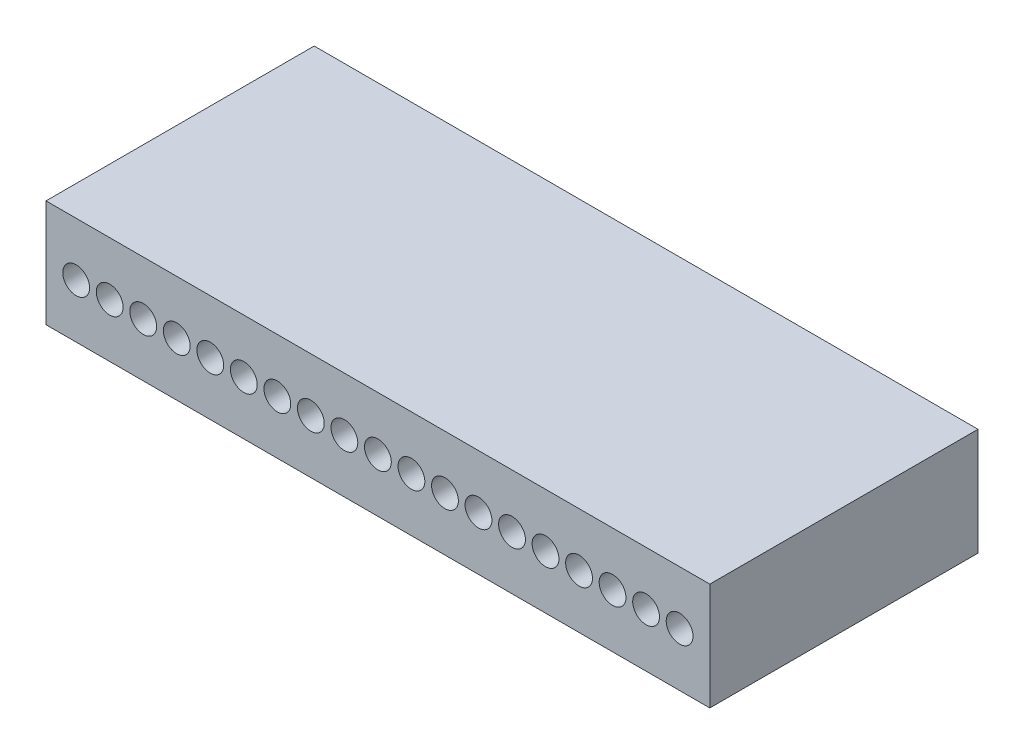
ISO-10303-21;
HEADER;
FILE_DESCRIPTION(('STEP AP214'),'2;1');
FILE_NAME('part.step','',(''),(''),'','','');
FILE_SCHEMA(('AUTOMOTIVE_DESIGN { 1 0 10303 214 1 1 1 1 }'));
ENDSEC;
DATA;
#1=APPLICATION_CONTEXT('core data for automotive mechanical design processes');
#2=APPLICATION_PROTOCOL_DEFINITION('international standard','automotive_design',2000,#1);
#3=PRODUCT_CONTEXT('',#1,'mechanical');
#4=PRODUCT('Part','Part','',(#3));
#5=PRODUCT_RELATED_PRODUCT_CATEGORY('part','',(#4));
#6=PRODUCT_DEFINITION_FORMATION('','',#4);
#7=PRODUCT_DEFINITION_CONTEXT('part definition',#1,'design');
#8=PRODUCT_DEFINITION('design','',#6,#7);
#9=PRODUCT_DEFINITION_SHAPE('','',#8);
#10=(LENGTH_UNIT() NAMED_UNIT(*) SI_UNIT(.MILLI.,.METRE.));
#11=(NAMED_UNIT(*) PLANE_ANGLE_UNIT() SI_UNIT($,.RADIAN.));
#12=(NAMED_UNIT(*) SI_UNIT($,.STERADIAN.) SOLID_ANGLE_UNIT());
#13=UNCERTAINTY_MEASURE_WITH_UNIT(LENGTH_MEASURE(1.E-05),#10,'distance_accuracy_value','');
#14=(GEOMETRIC_REPRESENTATION_CONTEXT(3) GLOBAL_UNCERTAINTY_ASSIGNED_CONTEXT((#13)) GLOBAL_UNIT_ASSIGNED_CONTEXT((#10,
#11,#12)) REPRESENTATION_CONTEXT('',''));
#15=CARTESIAN_POINT('',(0.,0.,0.));
#16=DIRECTION('',(0.,0.,1.));
#17=DIRECTION('',(1.,0.,0.));
#18=AXIS2_PLACEMENT_3D('',#15,#16,#17);
#19=CARTESIAN_POINT('',(0.,0.,10.));
#20=DIRECTION('',(1.,0.,0.));
#21=DIRECTION('',(0.,0.,-1.));
#22=AXIS2_PLACEMENT_3D('',#19,#20,#21);
#23=PLANE('',#22);
#24=DIRECTION('',(0.,-1.,0.));
#25=VECTOR('',#24,1.);
#26=CARTESIAN_POINT('',(0.,0.,0.));
#27=LINE('',#26,#25);
#28=CARTESIAN_POINT('',(0.,4.,0.));
#29=VERTEX_POINT('',#28);
#30=CARTESIAN_POINT('',(0.,0.,0.));
#31=VERTEX_POINT('',#30);
#32=EDGE_CURVE('E99',#29,#31,#27,.T.);
#33=ORIENTED_EDGE('',*,*,#32,.T.);
#34=DIRECTION('',(0.,0.,-1.));
#35=VECTOR('',#34,1.);
#36=CARTESIAN_POINT('',(0.,0.,10.));
#37=LINE('',#36,#35);
#38=CARTESIAN_POINT('',(0.,0.,10.));
#39=VERTEX_POINT('',#38);
#40=EDGE_CURVE('E11',#39,#31,#37,.T.);
#41=ORIENTED_EDGE('',*,*,#40,.F.);
#42=DIRECTION('',(0.,-1.,0.));
#43=VECTOR('',#42,1.);
#44=CARTESIAN_POINT('',(0.,0.,10.));
#45=LINE('',#44,#43);
#46=CARTESIAN_POINT('',(0.,4.,10.));
#47=VERTEX_POINT('',#46);
#48=EDGE_CURVE('E87',#47,#39,#45,.T.);
#49=ORIENTED_EDGE('',*,*,#48,.F.);
#50=DIRECTION('',(0.,0.,-1.));
#51=VECTOR('',#50,1.);
#52=CARTESIAN_POINT('',(0.,4.,10.));
#53=LINE('',#52,#51);
#54=EDGE_CURVE('E95',#47,#29,#53,.T.);
#55=ORIENTED_EDGE('',*,*,#54,.T.);
#56=EDGE_LOOP('',(#33,#41,#49,#55));
#57=FACE_BOUND('',#56,.T.);
#58=ADVANCED_FACE('F36',(#57),#23,.F.);
#59=CARTESIAN_POINT('',(0.,0.,10.));
#60=DIRECTION('',(0.,1.,0.));
#61=DIRECTION('',(0.,0.,1.));
#62=AXIS2_PLACEMENT_3D('',#59,#60,#61);
#63=PLANE('',#62);
#64=DIRECTION('',(1.,0.,0.));
#65=VECTOR('',#64,1.);
#66=CARTESIAN_POINT('',(0.,0.,0.));
#67=LINE('',#66,#65);
#68=CARTESIAN_POINT('',(24.75,0.,0.));
#69=VERTEX_POINT('',#68);
#70=EDGE_CURVE('E91',#31,#69,#67,.T.);
#71=ORIENTED_EDGE('',*,*,#70,.T.);
#72=DIRECTION('',(0.,0.,-1.));
#73=VECTOR('',#72,1.);
#74=CARTESIAN_POINT('',(24.75,0.,10.));
#75=LINE('',#74,#73);
#76=CARTESIAN_POINT('',(24.75,0.,10.));
#77=VERTEX_POINT('',#76);
#78=EDGE_CURVE('E44',#77,#69,#75,.T.);
#79=ORIENTED_EDGE('',*,*,#78,.F.);
#80=DIRECTION('',(1.,0.,0.));
#81=VECTOR('',#80,1.);
#82=CARTESIAN_POINT('',(0.,0.,10.));
#83=LINE('',#82,#81);
#84=EDGE_CURVE('E82',#39,#77,#83,.T.);
#85=ORIENTED_EDGE('',*,*,#84,.F.);
#86=ORIENTED_EDGE('',*,*,#40,.T.);
#87=EDGE_LOOP('',(#71,#79,#85,#86));
#88=FACE_BOUND('',#87,.T.);
#89=ADVANCED_FACE('F90',(#88),#63,.F.);
#90=CARTESIAN_POINT('',(24.75,0.,10.));
#91=DIRECTION('',(-1.,0.,0.));
#92=DIRECTION('',(0.,0.,1.));
#93=AXIS2_PLACEMENT_3D('',#90,#91,#92);
#94=PLANE('',#93);
#95=DIRECTION('',(0.,1.,0.));
#96=VECTOR('',#95,1.);
#97=CARTESIAN_POINT('',(24.75,0.,0.));
#98=LINE('',#97,#96);
#99=CARTESIAN_POINT('',(24.75,4.,0.));
#100=VERTEX_POINT('',#99);
#101=EDGE_CURVE('E69',#69,#100,#98,.T.);
#102=ORIENTED_EDGE('',*,*,#101,.T.);
#103=DIRECTION('',(0.,0.,-1.));
#104=VECTOR('',#103,1.);
#105=CARTESIAN_POINT('',(24.75,4.,10.));
#106=LINE('',#105,#104);
#107=CARTESIAN_POINT('',(24.75,4.,10.));
#108=VERTEX_POINT('',#107);
#109=EDGE_CURVE('E92',#108,#100,#106,.T.);
#110=ORIENTED_EDGE('',*,*,#109,.F.);
#111=DIRECTION('',(0.,1.,0.));
#112=VECTOR('',#111,1.);
#113=CARTESIAN_POINT('',(24.75,0.,10.));
#114=LINE('',#113,#112);
#115=EDGE_CURVE('E85',#77,#108,#114,.T.);
#116=ORIENTED_EDGE('',*,*,#115,.F.);
#117=ORIENTED_EDGE('',*,*,#78,.T.);
#118=EDGE_LOOP('',(#102,#110,#116,#117));
#119=FACE_BOUND('',#118,.T.);
#120=ADVANCED_FACE('F93',(#119),#94,.F.);
#121=CARTESIAN_POINT('',(0.,4.,10.));
#122=DIRECTION('',(0.,-1.,0.));
#123=DIRECTION('',(0.,0.,-1.));
#124=AXIS2_PLACEMENT_3D('',#121,#122,#123);
#125=PLANE('',#124);
#126=DIRECTION('',(-1.,0.,0.));
#127=VECTOR('',#126,1.);
#128=CARTESIAN_POINT('',(0.,4.,0.));
#129=LINE('',#128,#127);
#130=EDGE_CURVE('E75',#100,#29,#129,.T.);
#131=ORIENTED_EDGE('',*,*,#130,.T.);
#132=ORIENTED_EDGE('',*,*,#54,.F.);
#133=DIRECTION('',(-1.,0.,0.));
#134=VECTOR('',#133,1.);
#135=CARTESIAN_POINT('',(0.,4.,10.));
#136=LINE('',#135,#134);
#137=EDGE_CURVE('E52',#108,#47,#136,.T.);
#138=ORIENTED_EDGE('',*,*,#137,.F.);
#139=ORIENTED_EDGE('',*,*,#109,.T.);
#140=EDGE_LOOP('',(#131,#132,#138,#139));
#141=FACE_BOUND('',#140,.T.);
#142=ADVANCED_FACE('F107',(#141),#125,.F.);
#143=CARTESIAN_POINT('',(0.,0.,10.));
#144=DIRECTION('',(0.,0.,-1.));
#145=DIRECTION('',(-1.,0.,0.));
#146=AXIS2_PLACEMENT_3D('',#143,#144,#145);
#147=PLANE('',#146);
#148=CARTESIAN_POINT('',(1.125,2.,10.));
#149=DIRECTION('',(0.,0.,1.));
#150=DIRECTION('',(1.,0.,0.));
#151=AXIS2_PLACEMENT_3D('',#148,#149,#150);
#152=CIRCLE('',#151,0.5);
#153=CARTESIAN_POINT('',(1.625,2.,10.));
#154=VERTEX_POINT('',#153);
#155=EDGE_CURVE('E221',#154,#154,#152,.T.);
#156=ORIENTED_EDGE('',*,*,#155,.F.);
#157=EDGE_LOOP('',(#156));
#158=FACE_BOUND('',#157,.T.);
#159=CARTESIAN_POINT('',(2.375,2.,10.));
#160=DIRECTION('',(0.,0.,1.));
#161=DIRECTION('',(1.,0.,0.));
#162=AXIS2_PLACEMENT_3D('',#159,#160,#161);
#163=CIRCLE('',#162,0.5);
#164=CARTESIAN_POINT('',(2.875,2.,10.));
#165=VERTEX_POINT('',#164);
#166=EDGE_CURVE('E215',#165,#165,#163,.T.);
#167=ORIENTED_EDGE('',*,*,#166,.F.);
#168=EDGE_LOOP('',(#167));
#169=FACE_BOUND('',#168,.T.);
#170=CARTESIAN_POINT('',(3.625,2.,10.));
#171=DIRECTION('',(0.,0.,1.));
#172=DIRECTION('',(1.,0.,0.));
#173=AXIS2_PLACEMENT_3D('',#170,#171,#172);
#174=CIRCLE('',#173,0.5);
#175=CARTESIAN_POINT('',(4.125,2.,10.));
#176=VERTEX_POINT('',#175);
#177=EDGE_CURVE('E209',#176,#176,#174,.T.);
#178=ORIENTED_EDGE('',*,*,#177,.F.);
#179=EDGE_LOOP('',(#178));
#180=FACE_BOUND('',#179,.T.);
#181=CARTESIAN_POINT('',(4.875,2.,10.));
#182=DIRECTION('',(0.,0.,1.));
#183=DIRECTION('',(1.,0.,0.));
#184=AXIS2_PLACEMENT_3D('',#181,#182,#183);
#185=CIRCLE('',#184,0.5);
#186=CARTESIAN_POINT('',(5.375,2.,10.));
#187=VERTEX_POINT('',#186);
#188=EDGE_CURVE('E203',#187,#187,#185,.T.);
#189=ORIENTED_EDGE('',*,*,#188,.F.);
#190=EDGE_LOOP('',(#189));
#191=FACE_BOUND('',#190,.T.);
#192=CARTESIAN_POINT('',(6.125,2.,10.));
#193=DIRECTION('',(0.,0.,1.));
#194=DIRECTION('',(1.,0.,0.));
#195=AXIS2_PLACEMENT_3D('',#192,#193,#194);
#196=CIRCLE('',#195,0.5);
#197=CARTESIAN_POINT('',(6.625,2.,10.));
#198=VERTEX_POINT('',#197);
#199=EDGE_CURVE('E197',#198,#198,#196,.T.);
#200=ORIENTED_EDGE('',*,*,#199,.F.);
#201=EDGE_LOOP('',(#200));
#202=FACE_BOUND('',#201,.T.);
#203=CARTESIAN_POINT('',(7.375,2.,10.));
#204=DIRECTION('',(0.,0.,1.));
#205=DIRECTION('',(1.,0.,0.));
#206=AXIS2_PLACEMENT_3D('',#203,#204,#205);
#207=CIRCLE('',#206,0.500000000000002);
#208=CARTESIAN_POINT('',(7.875,2.,10.));
#209=VERTEX_POINT('',#208);
#210=EDGE_CURVE('E191',#209,#209,#207,.T.);
#211=ORIENTED_EDGE('',*,*,#210,.F.);
#212=EDGE_LOOP('',(#211));
#213=FACE_BOUND('',#212,.T.);
#214=CARTESIAN_POINT('',(8.625,2.,10.));
#215=DIRECTION('',(0.,0.,1.));
#216=DIRECTION('',(1.,0.,0.));
#217=AXIS2_PLACEMENT_3D('',#214,#215,#216);
#218=CIRCLE('',#217,0.499999999999999);
#219=CARTESIAN_POINT('',(9.125,2.,10.));
#220=VERTEX_POINT('',#219);
#221=EDGE_CURVE('E185',#220,#220,#218,.T.);
#222=ORIENTED_EDGE('',*,*,#221,.F.);
#223=EDGE_LOOP('',(#222));
#224=FACE_BOUND('',#223,.T.);
#225=CARTESIAN_POINT('',(9.875,2.,10.));
#226=DIRECTION('',(0.,0.,1.));
#227=DIRECTION('',(1.,0.,0.));
#228=AXIS2_PLACEMENT_3D('',#225,#226,#227);
#229=CIRCLE('',#228,0.499999999999999);
#230=CARTESIAN_POINT('',(10.375,2.,10.));
#231=VERTEX_POINT('',#230);
#232=EDGE_CURVE('E179',#231,#231,#229,.T.);
#233=ORIENTED_EDGE('',*,*,#232,.F.);
#234=EDGE_LOOP('',(#233));
#235=FACE_BOUND('',#234,.T.);
#236=CARTESIAN_POINT('',(11.125,2.,10.));
#237=DIRECTION('',(0.,0.,1.));
#238=DIRECTION('',(1.,0.,0.));
#239=AXIS2_PLACEMENT_3D('',#236,#237,#238);
#240=CIRCLE('',#239,0.499999999999999);
#241=CARTESIAN_POINT('',(11.625,2.,10.));
#242=VERTEX_POINT('',#241);
#243=EDGE_CURVE('E173',#242,#242,#240,.T.);
#244=ORIENTED_EDGE('',*,*,#243,.F.);
#245=EDGE_LOOP('',(#244));
#246=FACE_BOUND('',#245,.T.);
#247=CARTESIAN_POINT('',(12.375,2.,10.));
#248=DIRECTION('',(0.,0.,1.));
#249=DIRECTION('',(1.,0.,0.));
#250=AXIS2_PLACEMENT_3D('',#247,#248,#249);
#251=CIRCLE('',#250,0.499999999999999);
#252=CARTESIAN_POINT('',(12.875,2.,10.));
#253=VERTEX_POINT('',#252);
#254=EDGE_CURVE('E167',#253,#253,#251,.T.);
#255=ORIENTED_EDGE('',*,*,#254,.F.);
#256=EDGE_LOOP('',(#255));
#257=FACE_BOUND('',#256,.T.);
#258=CARTESIAN_POINT('',(13.625,2.,10.));
#259=DIRECTION('',(0.,0.,1.));
#260=DIRECTION('',(1.,0.,0.));
#261=AXIS2_PLACEMENT_3D('',#258,#259,#260);
#262=CIRCLE('',#261,0.499999999999999);
#263=CARTESIAN_POINT('',(14.125,2.,10.));
#264=VERTEX_POINT('',#263);
#265=EDGE_CURVE('E161',#264,#264,#262,.T.);
#266=ORIENTED_EDGE('',*,*,#265,.F.);
#267=EDGE_LOOP('',(#266));
#268=FACE_BOUND('',#267,.T.);
#269=CARTESIAN_POINT('',(14.875,2.,10.));
#270=DIRECTION('',(0.,0.,1.));
#271=DIRECTION('',(1.,0.,0.));
#272=AXIS2_PLACEMENT_3D('',#269,#270,#271);
#273=CIRCLE('',#272,0.499999999999999);
#274=CARTESIAN_POINT('',(15.375,2.,10.));
#275=VERTEX_POINT('',#274);
#276=EDGE_CURVE('E155',#275,#275,#273,.T.);
#277=ORIENTED_EDGE('',*,*,#276,.F.);
#278=EDGE_LOOP('',(#277));
#279=FACE_BOUND('',#278,.T.);
#280=CARTESIAN_POINT('',(16.125,2.,10.));
#281=DIRECTION('',(0.,0.,1.));
#282=DIRECTION('',(1.,0.,0.));
#283=AXIS2_PLACEMENT_3D('',#280,#281,#282);
#284=CIRCLE('',#283,0.499999999999999);
#285=CARTESIAN_POINT('',(16.625,2.,10.));
#286=VERTEX_POINT('',#285);
#287=EDGE_CURVE('E149',#286,#286,#284,.T.);
#288=ORIENTED_EDGE('',*,*,#287,.F.);
#289=EDGE_LOOP('',(#288));
#290=FACE_BOUND('',#289,.T.);
#291=CARTESIAN_POINT('',(17.375,2.,10.));
#292=DIRECTION('',(0.,0.,1.));
#293=DIRECTION('',(1.,0.,0.));
#294=AXIS2_PLACEMENT_3D('',#291,#292,#293);
#295=CIRCLE('',#294,0.499999999999999);
#296=CARTESIAN_POINT('',(17.875,2.,10.));
#297=VERTEX_POINT('',#296);
#298=EDGE_CURVE('E143',#297,#297,#295,.T.);
#299=ORIENTED_EDGE('',*,*,#298,.F.);
#300=EDGE_LOOP('',(#299));
#301=FACE_BOUND('',#300,.T.);
#302=CARTESIAN_POINT('',(18.625,2.,10.));
#303=DIRECTION('',(0.,0.,1.));
#304=DIRECTION('',(1.,0.,0.));
#305=AXIS2_PLACEMENT_3D('',#302,#303,#304);
#306=CIRCLE('',#305,0.499999999999999);
#307=CARTESIAN_POINT('',(19.125,2.,10.));
#308=VERTEX_POINT('',#307);
#309=EDGE_CURVE('E137',#308,#308,#306,.T.);
#310=ORIENTED_EDGE('',*,*,#309,.F.);
#311=EDGE_LOOP('',(#310));
#312=FACE_BOUND('',#311,.T.);
#313=CARTESIAN_POINT('',(19.875,2.,10.));
#314=DIRECTION('',(0.,0.,1.));
#315=DIRECTION('',(1.,0.,0.));
#316=AXIS2_PLACEMENT_3D('',#313,#314,#315);
#317=CIRCLE('',#316,0.499999999999999);
#318=CARTESIAN_POINT('',(20.375,2.,10.));
#319=VERTEX_POINT('',#318);
#320=EDGE_CURVE('E131',#319,#319,#317,.T.);
#321=ORIENTED_EDGE('',*,*,#320,.F.);
#322=EDGE_LOOP('',(#321));
#323=FACE_BOUND('',#322,.T.);
#324=CARTESIAN_POINT('',(21.125,2.,10.));
#325=DIRECTION('',(0.,0.,1.));
#326=DIRECTION('',(1.,0.,0.));
#327=AXIS2_PLACEMENT_3D('',#324,#325,#326);
#328=CIRCLE('',#327,0.499999999999999);
#329=CARTESIAN_POINT('',(21.625,2.,10.));
#330=VERTEX_POINT('',#329);
#331=EDGE_CURVE('E125',#330,#330,#328,.T.);
#332=ORIENTED_EDGE('',*,*,#331,.F.);
#333=EDGE_LOOP('',(#332));
#334=FACE_BOUND('',#333,.T.);
#335=CARTESIAN_POINT('',(22.375,2.,10.));
#336=DIRECTION('',(0.,0.,1.));
#337=DIRECTION('',(1.,0.,0.));
#338=AXIS2_PLACEMENT_3D('',#335,#336,#337);
#339=CIRCLE('',#338,0.499999999999999);
#340=CARTESIAN_POINT('',(22.875,2.,10.));
#341=VERTEX_POINT('',#340);
#342=EDGE_CURVE('E119',#341,#341,#339,.T.);
#343=ORIENTED_EDGE('',*,*,#342,.F.);
#344=EDGE_LOOP('',(#343));
#345=FACE_BOUND('',#344,.T.);
#346=CARTESIAN_POINT('',(23.625,2.,10.));
#347=DIRECTION('',(0.,0.,1.));
#348=DIRECTION('',(1.,0.,0.));
#349=AXIS2_PLACEMENT_3D('',#346,#347,#348);
#350=CIRCLE('',#349,0.499999999999999);
#351=CARTESIAN_POINT('',(24.125,2.,10.));
#352=VERTEX_POINT('',#351);
#353=EDGE_CURVE('E113',#352,#352,#350,.T.);
#354=ORIENTED_EDGE('',*,*,#353,.F.);
#355=EDGE_LOOP('',(#354));
#356=FACE_BOUND('',#355,.T.);
#357=ORIENTED_EDGE('',*,*,#48,.T.);
#358=ORIENTED_EDGE('',*,*,#84,.T.);
#359=ORIENTED_EDGE('',*,*,#115,.T.);
#360=ORIENTED_EDGE('',*,*,#137,.T.);
#361=EDGE_LOOP('',(#357,#358,#359,#360));
#362=FACE_BOUND('',#361,.T.);
#363=ADVANCED_FACE('F83',(#158,#169,#180,#191,#202,#213,#224,#235,#246,#257,#268,#279,#290,#301,
#312,#323,#334,#345,#356,#362),#147,.F.);
#364=CARTESIAN_POINT('',(0.,0.,0.));
#365=DIRECTION('',(0.,0.,-1.));
#366=DIRECTION('',(-1.,0.,0.));
#367=AXIS2_PLACEMENT_3D('',#364,#365,#366);
#368=PLANE('',#367);
#369=ORIENTED_EDGE('',*,*,#32,.F.);
#370=ORIENTED_EDGE('',*,*,#130,.F.);
#371=ORIENTED_EDGE('',*,*,#101,.F.);
#372=ORIENTED_EDGE('',*,*,#70,.F.);
#373=EDGE_LOOP('',(#369,#370,#371,#372));
#374=FACE_BOUND('',#373,.T.);
#375=ADVANCED_FACE('F110',(#374),#368,.T.);
#376=CARTESIAN_POINT('',(23.625,2.,5.));
#377=DIRECTION('',(0.,0.,1.));
#378=DIRECTION('',(1.,0.,0.));
#379=AXIS2_PLACEMENT_3D('',#376,#377,#378);
#380=CYLINDRICAL_SURFACE('',#379,0.499999999999999);
#381=CARTESIAN_POINT('',(23.625,2.,5.));
#382=DIRECTION('',(0.,0.,1.));
#383=DIRECTION('',(1.,0.,0.));
#384=AXIS2_PLACEMENT_3D('',#381,#382,#383);
#385=CIRCLE('',#384,0.499999999999999);
#386=CARTESIAN_POINT('',(24.125,2.,5.));
#387=VERTEX_POINT('',#386);
#388=EDGE_CURVE('E116',#387,#387,#385,.T.);
#389=ORIENTED_EDGE('',*,*,#388,.F.);
#390=EDGE_LOOP('',(#389));
#391=FACE_BOUND('',#390,.T.);
#392=ORIENTED_EDGE('',*,*,#353,.T.);
#393=EDGE_LOOP('',(#392));
#394=FACE_BOUND('',#393,.T.);
#395=ADVANCED_FACE('F275',(#391,#394),#380,.F.);
#396=CARTESIAN_POINT('',(23.625,2.,5.));
#397=DIRECTION('',(0.,0.,1.));
#398=DIRECTION('',(1.,0.,0.));
#399=AXIS2_PLACEMENT_3D('',#396,#397,#398);
#400=PLANE('',#399);
#401=ORIENTED_EDGE('',*,*,#388,.T.);
#402=EDGE_LOOP('',(#401));
#403=FACE_BOUND('',#402,.T.);
#404=ADVANCED_FACE('F277',(#403),#400,.T.);
#405=CARTESIAN_POINT('',(22.375,2.,5.));
#406=DIRECTION('',(0.,0.,1.));
#407=DIRECTION('',(1.,0.,0.));
#408=AXIS2_PLACEMENT_3D('',#405,#406,#407);
#409=CYLINDRICAL_SURFACE('',#408,0.499999999999999);
#410=CARTESIAN_POINT('',(22.375,2.,5.));
#411=DIRECTION('',(0.,0.,1.));
#412=DIRECTION('',(1.,0.,0.));
#413=AXIS2_PLACEMENT_3D('',#410,#411,#412);
#414=CIRCLE('',#413,0.499999999999999);
#415=CARTESIAN_POINT('',(22.875,2.,5.));
#416=VERTEX_POINT('',#415);
#417=EDGE_CURVE('E122',#416,#416,#414,.T.);
#418=ORIENTED_EDGE('',*,*,#417,.F.);
#419=EDGE_LOOP('',(#418));
#420=FACE_BOUND('',#419,.T.);
#421=ORIENTED_EDGE('',*,*,#342,.T.);
#422=EDGE_LOOP('',(#421));
#423=FACE_BOUND('',#422,.T.);
#424=ADVANCED_FACE('F284',(#420,#423),#409,.F.);
#425=CARTESIAN_POINT('',(22.375,2.,5.));
#426=DIRECTION('',(0.,0.,1.));
#427=DIRECTION('',(1.,0.,0.));
#428=AXIS2_PLACEMENT_3D('',#425,#426,#427);
#429=PLANE('',#428);
#430=ORIENTED_EDGE('',*,*,#417,.T.);
#431=EDGE_LOOP('',(#430));
#432=FACE_BOUND('',#431,.T.);
#433=ADVANCED_FACE('F332',(#432),#429,.T.);
#434=CARTESIAN_POINT('',(21.125,2.,5.));
#435=DIRECTION('',(0.,0.,1.));
#436=DIRECTION('',(1.,0.,0.));
#437=AXIS2_PLACEMENT_3D('',#434,#435,#436);
#438=CYLINDRICAL_SURFACE('',#437,0.499999999999999);
#439=CARTESIAN_POINT('',(21.125,2.,5.));
#440=DIRECTION('',(0.,0.,1.));
#441=DIRECTION('',(1.,0.,0.));
#442=AXIS2_PLACEMENT_3D('',#439,#440,#441);
#443=CIRCLE('',#442,0.499999999999999);
#444=CARTESIAN_POINT('',(21.625,2.,5.));
#445=VERTEX_POINT('',#444);
#446=EDGE_CURVE('E128',#445,#445,#443,.T.);
#447=ORIENTED_EDGE('',*,*,#446,.F.);
#448=EDGE_LOOP('',(#447));
#449=FACE_BOUND('',#448,.T.);
#450=ORIENTED_EDGE('',*,*,#331,.T.);
#451=EDGE_LOOP('',(#450));
#452=FACE_BOUND('',#451,.T.);
#453=ADVANCED_FACE('F341',(#449,#452),#438,.F.);
#454=CARTESIAN_POINT('',(21.125,2.,5.));
#455=DIRECTION('',(0.,0.,1.));
#456=DIRECTION('',(1.,0.,0.));
#457=AXIS2_PLACEMENT_3D('',#454,#455,#456);
#458=PLANE('',#457);
#459=ORIENTED_EDGE('',*,*,#446,.T.);
#460=EDGE_LOOP('',(#459));
#461=FACE_BOUND('',#460,.T.);
#462=ADVANCED_FACE('F350',(#461),#458,.T.);
#463=CARTESIAN_POINT('',(19.875,2.,5.));
#464=DIRECTION('',(0.,0.,1.));
#465=DIRECTION('',(1.,0.,0.));
#466=AXIS2_PLACEMENT_3D('',#463,#464,#465);
#467=CYLINDRICAL_SURFACE('',#466,0.499999999999999);
#468=CARTESIAN_POINT('',(19.875,2.,5.));
#469=DIRECTION('',(0.,0.,1.));
#470=DIRECTION('',(1.,0.,0.));
#471=AXIS2_PLACEMENT_3D('',#468,#469,#470);
#472=CIRCLE('',#471,0.499999999999999);
#473=CARTESIAN_POINT('',(20.375,2.,5.));
#474=VERTEX_POINT('',#473);
#475=EDGE_CURVE('E134',#474,#474,#472,.T.);
#476=ORIENTED_EDGE('',*,*,#475,.F.);
#477=EDGE_LOOP('',(#476));
#478=FACE_BOUND('',#477,.T.);
#479=ORIENTED_EDGE('',*,*,#320,.T.);
#480=EDGE_LOOP('',(#479));
#481=FACE_BOUND('',#480,.T.);
#482=ADVANCED_FACE('F359',(#478,#481),#467,.F.);
#483=CARTESIAN_POINT('',(19.875,2.,5.));
#484=DIRECTION('',(0.,0.,1.));
#485=DIRECTION('',(1.,0.,0.));
#486=AXIS2_PLACEMENT_3D('',#483,#484,#485);
#487=PLANE('',#486);
#488=ORIENTED_EDGE('',*,*,#475,.T.);
#489=EDGE_LOOP('',(#488));
#490=FACE_BOUND('',#489,.T.);
#491=ADVANCED_FACE('F368',(#490),#487,.T.);
#492=CARTESIAN_POINT('',(18.625,2.,5.));
#493=DIRECTION('',(0.,0.,1.));
#494=DIRECTION('',(1.,0.,0.));
#495=AXIS2_PLACEMENT_3D('',#492,#493,#494);
#496=CYLINDRICAL_SURFACE('',#495,0.499999999999999);
#497=CARTESIAN_POINT('',(18.625,2.,5.));
#498=DIRECTION('',(0.,0.,1.));
#499=DIRECTION('',(1.,0.,0.));
#500=AXIS2_PLACEMENT_3D('',#497,#498,#499);
#501=CIRCLE('',#500,0.499999999999999);
#502=CARTESIAN_POINT('',(19.125,2.,5.));
#503=VERTEX_POINT('',#502);
#504=EDGE_CURVE('E140',#503,#503,#501,.T.);
#505=ORIENTED_EDGE('',*,*,#504,.F.);
#506=EDGE_LOOP('',(#505));
#507=FACE_BOUND('',#506,.T.);
#508=ORIENTED_EDGE('',*,*,#309,.T.);
#509=EDGE_LOOP('',(#508));
#510=FACE_BOUND('',#509,.T.);
#511=ADVANCED_FACE('F377',(#507,#510),#496,.F.);
#512=CARTESIAN_POINT('',(18.625,2.,5.));
#513=DIRECTION('',(0.,0.,1.));
#514=DIRECTION('',(1.,0.,0.));
#515=AXIS2_PLACEMENT_3D('',#512,#513,#514);
#516=PLANE('',#515);
#517=ORIENTED_EDGE('',*,*,#504,.T.);
#518=EDGE_LOOP('',(#517));
#519=FACE_BOUND('',#518,.T.);
#520=ADVANCED_FACE('F386',(#519),#516,.T.);
#521=CARTESIAN_POINT('',(17.375,2.,5.));
#522=DIRECTION('',(0.,0.,1.));
#523=DIRECTION('',(1.,0.,0.));
#524=AXIS2_PLACEMENT_3D('',#521,#522,#523);
#525=CYLINDRICAL_SURFACE('',#524,0.499999999999999);
#526=CARTESIAN_POINT('',(17.375,2.,5.));
#527=DIRECTION('',(0.,0.,1.));
#528=DIRECTION('',(1.,0.,0.));
#529=AXIS2_PLACEMENT_3D('',#526,#527,#528);
#530=CIRCLE('',#529,0.499999999999999);
#531=CARTESIAN_POINT('',(17.875,2.,5.));
#532=VERTEX_POINT('',#531);
#533=EDGE_CURVE('E146',#532,#532,#530,.T.);
#534=ORIENTED_EDGE('',*,*,#533,.F.);
#535=EDGE_LOOP('',(#534));
#536=FACE_BOUND('',#535,.T.);
#537=ORIENTED_EDGE('',*,*,#298,.T.);
#538=EDGE_LOOP('',(#537));
#539=FACE_BOUND('',#538,.T.);
#540=ADVANCED_FACE('F395',(#536,#539),#525,.F.);
#541=CARTESIAN_POINT('',(17.375,2.,5.));
#542=DIRECTION('',(0.,0.,1.));
#543=DIRECTION('',(1.,0.,0.));
#544=AXIS2_PLACEMENT_3D('',#541,#542,#543);
#545=PLANE('',#544);
#546=ORIENTED_EDGE('',*,*,#533,.T.);
#547=EDGE_LOOP('',(#546));
#548=FACE_BOUND('',#547,.T.);
#549=ADVANCED_FACE('F404',(#548),#545,.T.);
#550=CARTESIAN_POINT('',(16.125,2.,5.));
#551=DIRECTION('',(0.,0.,1.));
#552=DIRECTION('',(1.,0.,0.));
#553=AXIS2_PLACEMENT_3D('',#550,#551,#552);
#554=CYLINDRICAL_SURFACE('',#553,0.499999999999999);
#555=CARTESIAN_POINT('',(16.125,2.,5.));
#556=DIRECTION('',(0.,0.,1.));
#557=DIRECTION('',(1.,0.,0.));
#558=AXIS2_PLACEMENT_3D('',#555,#556,#557);
#559=CIRCLE('',#558,0.499999999999999);
#560=CARTESIAN_POINT('',(16.625,2.,5.));
#561=VERTEX_POINT('',#560);
#562=EDGE_CURVE('E152',#561,#561,#559,.T.);
#563=ORIENTED_EDGE('',*,*,#562,.F.);
#564=EDGE_LOOP('',(#563));
#565=FACE_BOUND('',#564,.T.);
#566=ORIENTED_EDGE('',*,*,#287,.T.);
#567=EDGE_LOOP('',(#566));
#568=FACE_BOUND('',#567,.T.);
#569=ADVANCED_FACE('F413',(#565,#568),#554,.F.);
#570=CARTESIAN_POINT('',(16.125,2.,5.));
#571=DIRECTION('',(0.,0.,1.));
#572=DIRECTION('',(1.,0.,0.));
#573=AXIS2_PLACEMENT_3D('',#570,#571,#572);
#574=PLANE('',#573);
#575=ORIENTED_EDGE('',*,*,#562,.T.);
#576=EDGE_LOOP('',(#575));
#577=FACE_BOUND('',#576,.T.);
#578=ADVANCED_FACE('F422',(#577),#574,.T.);
#579=CARTESIAN_POINT('',(14.875,2.,5.));
#580=DIRECTION('',(0.,0.,1.));
#581=DIRECTION('',(1.,0.,0.));
#582=AXIS2_PLACEMENT_3D('',#579,#580,#581);
#583=CYLINDRICAL_SURFACE('',#582,0.499999999999999);
#584=CARTESIAN_POINT('',(14.875,2.,5.));
#585=DIRECTION('',(0.,0.,1.));
#586=DIRECTION('',(1.,0.,0.));
#587=AXIS2_PLACEMENT_3D('',#584,#585,#586);
#588=CIRCLE('',#587,0.499999999999999);
#589=CARTESIAN_POINT('',(15.375,2.,5.));
#590=VERTEX_POINT('',#589);
#591=EDGE_CURVE('E158',#590,#590,#588,.T.);
#592=ORIENTED_EDGE('',*,*,#591,.F.);
#593=EDGE_LOOP('',(#592));
#594=FACE_BOUND('',#593,.T.);
#595=ORIENTED_EDGE('',*,*,#276,.T.);
#596=EDGE_LOOP('',(#595));
#597=FACE_BOUND('',#596,.T.);
#598=ADVANCED_FACE('F431',(#594,#597),#583,.F.);
#599=CARTESIAN_POINT('',(14.875,2.,5.));
#600=DIRECTION('',(0.,0.,1.));
#601=DIRECTION('',(1.,0.,0.));
#602=AXIS2_PLACEMENT_3D('',#599,#600,#601);
#603=PLANE('',#602);
#604=ORIENTED_EDGE('',*,*,#591,.T.);
#605=EDGE_LOOP('',(#604));
#606=FACE_BOUND('',#605,.T.);
#607=ADVANCED_FACE('F440',(#606),#603,.T.);
#608=CARTESIAN_POINT('',(13.625,2.,5.));
#609=DIRECTION('',(0.,0.,1.));
#610=DIRECTION('',(1.,0.,0.));
#611=AXIS2_PLACEMENT_3D('',#608,#609,#610);
#612=CYLINDRICAL_SURFACE('',#611,0.499999999999999);
#613=CARTESIAN_POINT('',(13.625,2.,5.));
#614=DIRECTION('',(0.,0.,1.));
#615=DIRECTION('',(1.,0.,0.));
#616=AXIS2_PLACEMENT_3D('',#613,#614,#615);
#617=CIRCLE('',#616,0.499999999999999);
#618=CARTESIAN_POINT('',(14.125,2.,5.));
#619=VERTEX_POINT('',#618);
#620=EDGE_CURVE('E164',#619,#619,#617,.T.);
#621=ORIENTED_EDGE('',*,*,#620,.F.);
#622=EDGE_LOOP('',(#621));
#623=FACE_BOUND('',#622,.T.);
#624=ORIENTED_EDGE('',*,*,#265,.T.);
#625=EDGE_LOOP('',(#624));
#626=FACE_BOUND('',#625,.T.);
#627=ADVANCED_FACE('F449',(#623,#626),#612,.F.);
#628=CARTESIAN_POINT('',(13.625,2.,5.));
#629=DIRECTION('',(0.,0.,1.));
#630=DIRECTION('',(1.,0.,0.));
#631=AXIS2_PLACEMENT_3D('',#628,#629,#630);
#632=PLANE('',#631);
#633=ORIENTED_EDGE('',*,*,#620,.T.);
#634=EDGE_LOOP('',(#633));
#635=FACE_BOUND('',#634,.T.);
#636=ADVANCED_FACE('F458',(#635),#632,.T.);
#637=CARTESIAN_POINT('',(12.375,2.,5.));
#638=DIRECTION('',(0.,0.,1.));
#639=DIRECTION('',(1.,0.,0.));
#640=AXIS2_PLACEMENT_3D('',#637,#638,#639);
#641=CYLINDRICAL_SURFACE('',#640,0.499999999999999);
#642=CARTESIAN_POINT('',(12.375,2.,5.));
#643=DIRECTION('',(0.,0.,1.));
#644=DIRECTION('',(1.,0.,0.));
#645=AXIS2_PLACEMENT_3D('',#642,#643,#644);
#646=CIRCLE('',#645,0.499999999999999);
#647=CARTESIAN_POINT('',(12.875,2.,5.));
#648=VERTEX_POINT('',#647);
#649=EDGE_CURVE('E170',#648,#648,#646,.T.);
#650=ORIENTED_EDGE('',*,*,#649,.F.);
#651=EDGE_LOOP('',(#650));
#652=FACE_BOUND('',#651,.T.);
#653=ORIENTED_EDGE('',*,*,#254,.T.);
#654=EDGE_LOOP('',(#653));
#655=FACE_BOUND('',#654,.T.);
#656=ADVANCED_FACE('F467',(#652,#655),#641,.F.);
#657=CARTESIAN_POINT('',(12.375,2.,5.));
#658=DIRECTION('',(0.,0.,1.));
#659=DIRECTION('',(1.,0.,0.));
#660=AXIS2_PLACEMENT_3D('',#657,#658,#659);
#661=PLANE('',#660);
#662=ORIENTED_EDGE('',*,*,#649,.T.);
#663=EDGE_LOOP('',(#662));
#664=FACE_BOUND('',#663,.T.);
#665=ADVANCED_FACE('F476',(#664),#661,.T.);
#666=CARTESIAN_POINT('',(11.125,2.,5.));
#667=DIRECTION('',(0.,0.,1.));
#668=DIRECTION('',(1.,0.,0.));
#669=AXIS2_PLACEMENT_3D('',#666,#667,#668);
#670=CYLINDRICAL_SURFACE('',#669,0.499999999999999);
#671=CARTESIAN_POINT('',(11.125,2.,5.));
#672=DIRECTION('',(0.,0.,1.));
#673=DIRECTION('',(1.,0.,0.));
#674=AXIS2_PLACEMENT_3D('',#671,#672,#673);
#675=CIRCLE('',#674,0.499999999999999);
#676=CARTESIAN_POINT('',(11.625,2.,5.));
#677=VERTEX_POINT('',#676);
#678=EDGE_CURVE('E176',#677,#677,#675,.T.);
#679=ORIENTED_EDGE('',*,*,#678,.F.);
#680=EDGE_LOOP('',(#679));
#681=FACE_BOUND('',#680,.T.);
#682=ORIENTED_EDGE('',*,*,#243,.T.);
#683=EDGE_LOOP('',(#682));
#684=FACE_BOUND('',#683,.T.);
#685=ADVANCED_FACE('F485',(#681,#684),#670,.F.);
#686=CARTESIAN_POINT('',(11.125,2.,5.));
#687=DIRECTION('',(0.,0.,1.));
#688=DIRECTION('',(1.,0.,0.));
#689=AXIS2_PLACEMENT_3D('',#686,#687,#688);
#690=PLANE('',#689);
#691=ORIENTED_EDGE('',*,*,#678,.T.);
#692=EDGE_LOOP('',(#691));
#693=FACE_BOUND('',#692,.T.);
#694=ADVANCED_FACE('F494',(#693),#690,.T.);
#695=CARTESIAN_POINT('',(9.875,2.,5.));
#696=DIRECTION('',(0.,0.,1.));
#697=DIRECTION('',(1.,0.,0.));
#698=AXIS2_PLACEMENT_3D('',#695,#696,#697);
#699=CYLINDRICAL_SURFACE('',#698,0.499999999999999);
#700=CARTESIAN_POINT('',(9.875,2.,5.));
#701=DIRECTION('',(0.,0.,1.));
#702=DIRECTION('',(1.,0.,0.));
#703=AXIS2_PLACEMENT_3D('',#700,#701,#702);
#704=CIRCLE('',#703,0.499999999999999);
#705=CARTESIAN_POINT('',(10.375,2.,5.));
#706=VERTEX_POINT('',#705);
#707=EDGE_CURVE('E182',#706,#706,#704,.T.);
#708=ORIENTED_EDGE('',*,*,#707,.F.);
#709=EDGE_LOOP('',(#708));
#710=FACE_BOUND('',#709,.T.);
#711=ORIENTED_EDGE('',*,*,#232,.T.);
#712=EDGE_LOOP('',(#711));
#713=FACE_BOUND('',#712,.T.);
#714=ADVANCED_FACE('F503',(#710,#713),#699,.F.);
#715=CARTESIAN_POINT('',(9.875,2.,5.));
#716=DIRECTION('',(0.,0.,1.));
#717=DIRECTION('',(1.,0.,0.));
#718=AXIS2_PLACEMENT_3D('',#715,#716,#717);
#719=PLANE('',#718);
#720=ORIENTED_EDGE('',*,*,#707,.T.);
#721=EDGE_LOOP('',(#720));
#722=FACE_BOUND('',#721,.T.);
#723=ADVANCED_FACE('F512',(#722),#719,.T.);
#724=CARTESIAN_POINT('',(8.625,2.,5.));
#725=DIRECTION('',(0.,0.,1.));
#726=DIRECTION('',(1.,0.,0.));
#727=AXIS2_PLACEMENT_3D('',#724,#725,#726);
#728=CYLINDRICAL_SURFACE('',#727,0.499999999999999);
#729=CARTESIAN_POINT('',(8.625,2.,5.));
#730=DIRECTION('',(0.,0.,1.));
#731=DIRECTION('',(1.,0.,0.));
#732=AXIS2_PLACEMENT_3D('',#729,#730,#731);
#733=CIRCLE('',#732,0.499999999999999);
#734=CARTESIAN_POINT('',(9.125,2.,5.));
#735=VERTEX_POINT('',#734);
#736=EDGE_CURVE('E188',#735,#735,#733,.T.);
#737=ORIENTED_EDGE('',*,*,#736,.F.);
#738=EDGE_LOOP('',(#737));
#739=FACE_BOUND('',#738,.T.);
#740=ORIENTED_EDGE('',*,*,#221,.T.);
#741=EDGE_LOOP('',(#740));
#742=FACE_BOUND('',#741,.T.);
#743=ADVANCED_FACE('F521',(#739,#742),#728,.F.);
#744=CARTESIAN_POINT('',(8.625,2.,5.));
#745=DIRECTION('',(0.,0.,1.));
#746=DIRECTION('',(1.,0.,0.));
#747=AXIS2_PLACEMENT_3D('',#744,#745,#746);
#748=PLANE('',#747);
#749=ORIENTED_EDGE('',*,*,#736,.T.);
#750=EDGE_LOOP('',(#749));
#751=FACE_BOUND('',#750,.T.);
#752=ADVANCED_FACE('F530',(#751),#748,.T.);
#753=CARTESIAN_POINT('',(7.375,2.,5.));
#754=DIRECTION('',(0.,0.,1.));
#755=DIRECTION('',(1.,0.,0.));
#756=AXIS2_PLACEMENT_3D('',#753,#754,#755);
#757=CYLINDRICAL_SURFACE('',#756,0.500000000000002);
#758=CARTESIAN_POINT('',(7.375,2.,5.));
#759=DIRECTION('',(0.,0.,1.));
#760=DIRECTION('',(1.,0.,0.));
#761=AXIS2_PLACEMENT_3D('',#758,#759,#760);
#762=CIRCLE('',#761,0.500000000000002);
#763=CARTESIAN_POINT('',(7.875,2.,5.));
#764=VERTEX_POINT('',#763);
#765=EDGE_CURVE('E194',#764,#764,#762,.T.);
#766=ORIENTED_EDGE('',*,*,#765,.F.);
#767=EDGE_LOOP('',(#766));
#768=FACE_BOUND('',#767,.T.);
#769=ORIENTED_EDGE('',*,*,#210,.T.);
#770=EDGE_LOOP('',(#769));
#771=FACE_BOUND('',#770,.T.);
#772=ADVANCED_FACE('F539',(#768,#771),#757,.F.);
#773=CARTESIAN_POINT('',(7.375,2.,5.));
#774=DIRECTION('',(0.,0.,1.));
#775=DIRECTION('',(1.,0.,0.));
#776=AXIS2_PLACEMENT_3D('',#773,#774,#775);
#777=PLANE('',#776);
#778=ORIENTED_EDGE('',*,*,#765,.T.);
#779=EDGE_LOOP('',(#778));
#780=FACE_BOUND('',#779,.T.);
#781=ADVANCED_FACE('F548',(#780),#777,.T.);
#782=CARTESIAN_POINT('',(6.125,2.,5.));
#783=DIRECTION('',(0.,0.,1.));
#784=DIRECTION('',(1.,0.,0.));
#785=AXIS2_PLACEMENT_3D('',#782,#783,#784);
#786=CYLINDRICAL_SURFACE('',#785,0.5);
#787=CARTESIAN_POINT('',(6.125,2.,5.));
#788=DIRECTION('',(0.,0.,1.));
#789=DIRECTION('',(1.,0.,0.));
#790=AXIS2_PLACEMENT_3D('',#787,#788,#789);
#791=CIRCLE('',#790,0.5);
#792=CARTESIAN_POINT('',(6.625,2.,5.));
#793=VERTEX_POINT('',#792);
#794=EDGE_CURVE('E200',#793,#793,#791,.T.);
#795=ORIENTED_EDGE('',*,*,#794,.F.);
#796=EDGE_LOOP('',(#795));
#797=FACE_BOUND('',#796,.T.);
#798=ORIENTED_EDGE('',*,*,#199,.T.);
#799=EDGE_LOOP('',(#798));
#800=FACE_BOUND('',#799,.T.);
#801=ADVANCED_FACE('F557',(#797,#800),#786,.F.);
#802=CARTESIAN_POINT('',(6.125,2.,5.));
#803=DIRECTION('',(0.,0.,1.));
#804=DIRECTION('',(1.,0.,0.));
#805=AXIS2_PLACEMENT_3D('',#802,#803,#804);
#806=PLANE('',#805);
#807=ORIENTED_EDGE('',*,*,#794,.T.);
#808=EDGE_LOOP('',(#807));
#809=FACE_BOUND('',#808,.T.);
#810=ADVANCED_FACE('F566',(#809),#806,.T.);
#811=CARTESIAN_POINT('',(4.875,2.,5.));
#812=DIRECTION('',(0.,0.,1.));
#813=DIRECTION('',(1.,0.,0.));
#814=AXIS2_PLACEMENT_3D('',#811,#812,#813);
#815=CYLINDRICAL_SURFACE('',#814,0.5);
#816=CARTESIAN_POINT('',(4.875,2.,5.));
#817=DIRECTION('',(0.,0.,1.));
#818=DIRECTION('',(1.,0.,0.));
#819=AXIS2_PLACEMENT_3D('',#816,#817,#818);
#820=CIRCLE('',#819,0.5);
#821=CARTESIAN_POINT('',(5.375,2.,5.));
#822=VERTEX_POINT('',#821);
#823=EDGE_CURVE('E206',#822,#822,#820,.T.);
#824=ORIENTED_EDGE('',*,*,#823,.F.);
#825=EDGE_LOOP('',(#824));
#826=FACE_BOUND('',#825,.T.);
#827=ORIENTED_EDGE('',*,*,#188,.T.);
#828=EDGE_LOOP('',(#827));
#829=FACE_BOUND('',#828,.T.);
#830=ADVANCED_FACE('F575',(#826,#829),#815,.F.);
#831=CARTESIAN_POINT('',(4.875,2.,5.));
#832=DIRECTION('',(0.,0.,1.));
#833=DIRECTION('',(1.,0.,0.));
#834=AXIS2_PLACEMENT_3D('',#831,#832,#833);
#835=PLANE('',#834);
#836=ORIENTED_EDGE('',*,*,#823,.T.);
#837=EDGE_LOOP('',(#836));
#838=FACE_BOUND('',#837,.T.);
#839=ADVANCED_FACE('F584',(#838),#835,.T.);
#840=CARTESIAN_POINT('',(3.625,2.,5.));
#841=DIRECTION('',(0.,0.,1.));
#842=DIRECTION('',(1.,0.,0.));
#843=AXIS2_PLACEMENT_3D('',#840,#841,#842);
#844=CYLINDRICAL_SURFACE('',#843,0.5);
#845=CARTESIAN_POINT('',(3.625,2.,5.));
#846=DIRECTION('',(0.,0.,1.));
#847=DIRECTION('',(1.,0.,0.));
#848=AXIS2_PLACEMENT_3D('',#845,#846,#847);
#849=CIRCLE('',#848,0.5);
#850=CARTESIAN_POINT('',(4.125,2.,5.));
#851=VERTEX_POINT('',#850);
#852=EDGE_CURVE('E212',#851,#851,#849,.T.);
#853=ORIENTED_EDGE('',*,*,#852,.F.);
#854=EDGE_LOOP('',(#853));
#855=FACE_BOUND('',#854,.T.);
#856=ORIENTED_EDGE('',*,*,#177,.T.);
#857=EDGE_LOOP('',(#856));
#858=FACE_BOUND('',#857,.T.);
#859=ADVANCED_FACE('F593',(#855,#858),#844,.F.);
#860=CARTESIAN_POINT('',(3.625,2.,5.));
#861=DIRECTION('',(0.,0.,1.));
#862=DIRECTION('',(1.,0.,0.));
#863=AXIS2_PLACEMENT_3D('',#860,#861,#862);
#864=PLANE('',#863);
#865=ORIENTED_EDGE('',*,*,#852,.T.);
#866=EDGE_LOOP('',(#865));
#867=FACE_BOUND('',#866,.T.);
#868=ADVANCED_FACE('F602',(#867),#864,.T.);
#869=CARTESIAN_POINT('',(2.375,2.,5.));
#870=DIRECTION('',(0.,0.,1.));
#871=DIRECTION('',(1.,0.,0.));
#872=AXIS2_PLACEMENT_3D('',#869,#870,#871);
#873=CYLINDRICAL_SURFACE('',#872,0.5);
#874=CARTESIAN_POINT('',(2.375,2.,5.));
#875=DIRECTION('',(0.,0.,1.));
#876=DIRECTION('',(1.,0.,0.));
#877=AXIS2_PLACEMENT_3D('',#874,#875,#876);
#878=CIRCLE('',#877,0.5);
#879=CARTESIAN_POINT('',(2.875,2.,5.));
#880=VERTEX_POINT('',#879);
#881=EDGE_CURVE('E218',#880,#880,#878,.T.);
#882=ORIENTED_EDGE('',*,*,#881,.F.);
#883=EDGE_LOOP('',(#882));
#884=FACE_BOUND('',#883,.T.);
#885=ORIENTED_EDGE('',*,*,#166,.T.);
#886=EDGE_LOOP('',(#885));
#887=FACE_BOUND('',#886,.T.);
#888=ADVANCED_FACE('F611',(#884,#887),#873,.F.);
#889=CARTESIAN_POINT('',(2.375,2.,5.));
#890=DIRECTION('',(0.,0.,1.));
#891=DIRECTION('',(1.,0.,0.));
#892=AXIS2_PLACEMENT_3D('',#889,#890,#891);
#893=PLANE('',#892);
#894=ORIENTED_EDGE('',*,*,#881,.T.);
#895=EDGE_LOOP('',(#894));
#896=FACE_BOUND('',#895,.T.);
#897=ADVANCED_FACE('F232',(#896),#893,.T.);
#898=CARTESIAN_POINT('',(1.125,2.,5.));
#899=DIRECTION('',(0.,0.,1.));
#900=DIRECTION('',(1.,0.,0.));
#901=AXIS2_PLACEMENT_3D('',#898,#899,#900);
#902=CYLINDRICAL_SURFACE('',#901,0.5);
#903=CARTESIAN_POINT('',(1.125,2.,5.));
#904=DIRECTION('',(0.,0.,1.));
#905=DIRECTION('',(1.,0.,0.));
#906=AXIS2_PLACEMENT_3D('',#903,#904,#905);
#907=CIRCLE('',#906,0.5);
#908=CARTESIAN_POINT('',(1.625,2.,5.));
#909=VERTEX_POINT('',#908);
#910=EDGE_CURVE('E102',#909,#909,#907,.T.);
#911=ORIENTED_EDGE('',*,*,#910,.F.);
#912=EDGE_LOOP('',(#911));
#913=FACE_BOUND('',#912,.T.);
#914=ORIENTED_EDGE('',*,*,#155,.T.);
#915=EDGE_LOOP('',(#914));
#916=FACE_BOUND('',#915,.T.);
#917=ADVANCED_FACE('F229',(#913,#916),#902,.F.);
#918=CARTESIAN_POINT('',(1.125,2.,5.));
#919=DIRECTION('',(0.,0.,1.));
#920=DIRECTION('',(1.,0.,0.));
#921=AXIS2_PLACEMENT_3D('',#918,#919,#920);
#922=PLANE('',#921);
#923=ORIENTED_EDGE('',*,*,#910,.T.);
#924=EDGE_LOOP('',(#923));
#925=FACE_BOUND('',#924,.T.);
#926=ADVANCED_FACE('F227',(#925),#922,.T.);
#927=CLOSED_SHELL('',(#58,#89,#120,#142,#363,#375,#395,#404,#424,#433,#453,#462,#482,#491,#511,
#520,#540,#549,#569,#578,#598,#607,#627,#636,#656,#665,#685,#694,#714,#723,#743,#752,#772,#781,
#801,#810,#830,#839,#859,#868,#888,#897,#917,#926));
#928=MANIFOLD_SOLID_BREP('B2',#927);
#929=ADVANCED_BREP_SHAPE_REPRESENTATION('',(#18,#928),#14);
#930=SHAPE_DEFINITION_REPRESENTATION(#9,#929);
ENDSEC;
END-ISO-10303-21;
